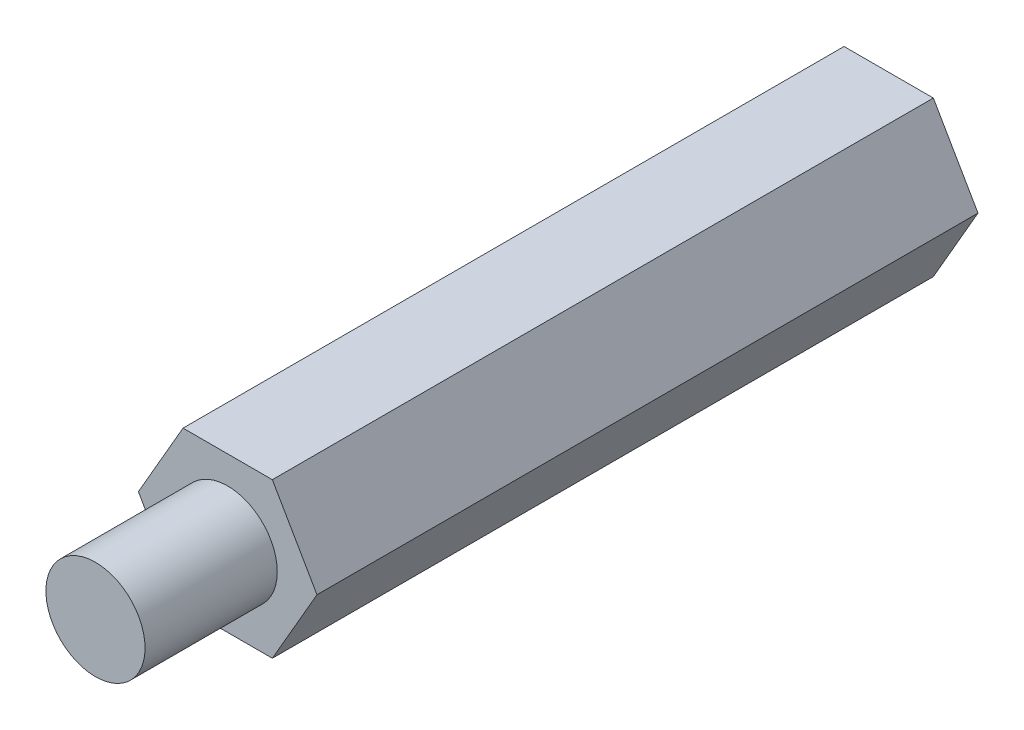
ISO-10303-21;
HEADER;
FILE_DESCRIPTION(('STEP AP214'),'2;1');
FILE_NAME('part.step','',(''),(''),'','','');
FILE_SCHEMA(('AUTOMOTIVE_DESIGN { 1 0 10303 214 1 1 1 1 }'));
ENDSEC;
DATA;
#1=APPLICATION_CONTEXT('core data for automotive mechanical design processes');
#2=APPLICATION_PROTOCOL_DEFINITION('international standard','automotive_design',2000,#1);
#3=PRODUCT_CONTEXT('',#1,'mechanical');
#4=PRODUCT('Part','Part','',(#3));
#5=PRODUCT_RELATED_PRODUCT_CATEGORY('part','',(#4));
#6=PRODUCT_DEFINITION_FORMATION('','',#4);
#7=PRODUCT_DEFINITION_CONTEXT('part definition',#1,'design');
#8=PRODUCT_DEFINITION('design','',#6,#7);
#9=PRODUCT_DEFINITION_SHAPE('','',#8);
#10=(LENGTH_UNIT() NAMED_UNIT(*) SI_UNIT(.MILLI.,.METRE.));
#11=(NAMED_UNIT(*) PLANE_ANGLE_UNIT() SI_UNIT($,.RADIAN.));
#12=(NAMED_UNIT(*) SI_UNIT($,.STERADIAN.) SOLID_ANGLE_UNIT());
#13=UNCERTAINTY_MEASURE_WITH_UNIT(LENGTH_MEASURE(1.E-05),#10,'distance_accuracy_value','');
#14=(GEOMETRIC_REPRESENTATION_CONTEXT(3) GLOBAL_UNCERTAINTY_ASSIGNED_CONTEXT((#13)) GLOBAL_UNIT_ASSIGNED_CONTEXT((#10,
#11,#12)) REPRESENTATION_CONTEXT('',''));
#15=CARTESIAN_POINT('',(0.,0.,0.));
#16=DIRECTION('',(0.,0.,1.));
#17=DIRECTION('',(1.,0.,0.));
#18=AXIS2_PLACEMENT_3D('',#15,#16,#17);
#19=CARTESIAN_POINT('',(1.35099962990375,-2.33999999999999,20.));
#20=DIRECTION('',(-0.866025403784442,0.499999999999995,0.));
#21=DIRECTION('',(-0.499999999999995,-0.866025403784442,0.));
#22=AXIS2_PLACEMENT_3D('',#19,#20,#21);
#23=PLANE('',#22);
#24=DIRECTION('',(0.499999999999995,0.866025403784441,0.));
#25=VECTOR('',#24,1.);
#26=CARTESIAN_POINT('',(1.35099962990375,-2.33999999999999,0.));
#27=LINE('',#26,#25);
#28=CARTESIAN_POINT('',(1.35099962990375,-2.33999999999999,0.));
#29=VERTEX_POINT('',#28);
#30=CARTESIAN_POINT('',(2.70199925980745,0.,0.));
#31=VERTEX_POINT('',#30);
#32=EDGE_CURVE('E125',#29,#31,#27,.T.);
#33=ORIENTED_EDGE('',*,*,#32,.T.);
#34=DIRECTION('',(0.,0.,-1.));
#35=VECTOR('',#34,1.);
#36=CARTESIAN_POINT('',(2.70199925980745,0.,20.));
#37=LINE('',#36,#35);
#38=CARTESIAN_POINT('',(2.70199925980745,0.,20.));
#39=VERTEX_POINT('',#38);
#40=EDGE_CURVE('E40',#39,#31,#37,.T.);
#41=ORIENTED_EDGE('',*,*,#40,.F.);
#42=DIRECTION('',(0.499999999999995,0.866025403784441,0.));
#43=VECTOR('',#42,1.);
#44=CARTESIAN_POINT('',(1.35099962990375,-2.33999999999999,20.));
#45=LINE('',#44,#43);
#46=CARTESIAN_POINT('',(1.35099962990375,-2.33999999999999,20.));
#47=VERTEX_POINT('',#46);
#48=EDGE_CURVE('E136',#47,#39,#45,.T.);
#49=ORIENTED_EDGE('',*,*,#48,.F.);
#50=DIRECTION('',(0.,0.,-1.));
#51=VECTOR('',#50,1.);
#52=CARTESIAN_POINT('',(1.35099962990375,-2.33999999999999,20.));
#53=LINE('',#52,#51);
#54=EDGE_CURVE('E121',#47,#29,#53,.T.);
#55=ORIENTED_EDGE('',*,*,#54,.T.);
#56=EDGE_LOOP('',(#33,#41,#49,#55));
#57=FACE_BOUND('',#56,.T.);
#58=ADVANCED_FACE('F37',(#57),#23,.F.);
#59=CARTESIAN_POINT('',(2.70199925980745,0.,20.));
#60=DIRECTION('',(-0.866025403784438,-0.500000000000001,0.));
#61=DIRECTION('',(0.500000000000001,-0.866025403784438,0.));
#62=AXIS2_PLACEMENT_3D('',#59,#60,#61);
#63=PLANE('',#62);
#64=DIRECTION('',(-0.500000000000001,0.866025403784438,0.));
#65=VECTOR('',#64,1.);
#66=CARTESIAN_POINT('',(2.70199925980745,0.,0.));
#67=LINE('',#66,#65);
#68=CARTESIAN_POINT('',(1.35099962990372,2.34,0.));
#69=VERTEX_POINT('',#68);
#70=EDGE_CURVE('E128',#31,#69,#67,.T.);
#71=ORIENTED_EDGE('',*,*,#70,.T.);
#72=DIRECTION('',(0.,0.,-1.));
#73=VECTOR('',#72,1.);
#74=CARTESIAN_POINT('',(1.35099962990372,2.34,20.));
#75=LINE('',#74,#73);
#76=CARTESIAN_POINT('',(1.35099962990372,2.34,20.));
#77=VERTEX_POINT('',#76);
#78=EDGE_CURVE('E139',#77,#69,#75,.T.);
#79=ORIENTED_EDGE('',*,*,#78,.F.);
#80=DIRECTION('',(-0.500000000000001,0.866025403784438,0.));
#81=VECTOR('',#80,1.);
#82=CARTESIAN_POINT('',(2.70199925980745,0.,20.));
#83=LINE('',#82,#81);
#84=EDGE_CURVE('E93',#39,#77,#83,.T.);
#85=ORIENTED_EDGE('',*,*,#84,.F.);
#86=ORIENTED_EDGE('',*,*,#40,.T.);
#87=EDGE_LOOP('',(#71,#79,#85,#86));
#88=FACE_BOUND('',#87,.T.);
#89=ADVANCED_FACE('F144',(#88),#63,.F.);
#90=CARTESIAN_POINT('',(1.35099962990372,2.34,20.));
#91=DIRECTION('',(0.,-1.,0.));
#92=DIRECTION('',(1.,0.,0.));
#93=AXIS2_PLACEMENT_3D('',#90,#91,#92);
#94=PLANE('',#93);
#95=DIRECTION('',(-1.,0.,0.));
#96=VECTOR('',#95,1.);
#97=CARTESIAN_POINT('',(1.35099962990372,2.34,0.));
#98=LINE('',#97,#96);
#99=CARTESIAN_POINT('',(-1.35099962990374,2.34,0.));
#100=VERTEX_POINT('',#99);
#101=EDGE_CURVE('E131',#69,#100,#98,.T.);
#102=ORIENTED_EDGE('',*,*,#101,.T.);
#103=DIRECTION('',(0.,0.,-1.));
#104=VECTOR('',#103,1.);
#105=CARTESIAN_POINT('',(-1.35099962990374,2.34,20.));
#106=LINE('',#105,#104);
#107=CARTESIAN_POINT('',(-1.35099962990374,2.34,20.));
#108=VERTEX_POINT('',#107);
#109=EDGE_CURVE('E116',#108,#100,#106,.T.);
#110=ORIENTED_EDGE('',*,*,#109,.F.);
#111=DIRECTION('',(-1.,0.,0.));
#112=VECTOR('',#111,1.);
#113=CARTESIAN_POINT('',(1.35099962990372,2.34,20.));
#114=LINE('',#113,#112);
#115=EDGE_CURVE('E107',#77,#108,#114,.T.);
#116=ORIENTED_EDGE('',*,*,#115,.F.);
#117=ORIENTED_EDGE('',*,*,#78,.T.);
#118=EDGE_LOOP('',(#102,#110,#116,#117));
#119=FACE_BOUND('',#118,.T.);
#120=ADVANCED_FACE('F150',(#119),#94,.F.);
#121=CARTESIAN_POINT('',(-1.35099962990374,2.34,20.));
#122=DIRECTION('',(0.866025403784442,-0.499999999999995,0.));
#123=DIRECTION('',(0.499999999999995,0.866025403784442,0.));
#124=AXIS2_PLACEMENT_3D('',#121,#122,#123);
#125=PLANE('',#124);
#126=DIRECTION('',(-0.499999999999995,-0.866025403784442,0.));
#127=VECTOR('',#126,1.);
#128=CARTESIAN_POINT('',(-1.35099962990374,2.34,0.));
#129=LINE('',#128,#127);
#130=CARTESIAN_POINT('',(-2.70199925980745,0.,0.));
#131=VERTEX_POINT('',#130);
#132=EDGE_CURVE('E115',#100,#131,#129,.T.);
#133=ORIENTED_EDGE('',*,*,#132,.T.);
#134=DIRECTION('',(0.,0.,-1.));
#135=VECTOR('',#134,1.);
#136=CARTESIAN_POINT('',(-2.70199925980745,0.,20.));
#137=LINE('',#136,#135);
#138=CARTESIAN_POINT('',(-2.70199925980745,0.,20.));
#139=VERTEX_POINT('',#138);
#140=EDGE_CURVE('E112',#139,#131,#137,.T.);
#141=ORIENTED_EDGE('',*,*,#140,.F.);
#142=DIRECTION('',(-0.499999999999995,-0.866025403784442,0.));
#143=VECTOR('',#142,1.);
#144=CARTESIAN_POINT('',(-1.35099962990374,2.34,20.));
#145=LINE('',#144,#143);
#146=EDGE_CURVE('E101',#108,#139,#145,.T.);
#147=ORIENTED_EDGE('',*,*,#146,.F.);
#148=ORIENTED_EDGE('',*,*,#109,.T.);
#149=EDGE_LOOP('',(#133,#141,#147,#148));
#150=FACE_BOUND('',#149,.T.);
#151=ADVANCED_FACE('F113',(#150),#125,.F.);
#152=CARTESIAN_POINT('',(-2.70199925980745,0.,20.));
#153=DIRECTION('',(0.866025403784435,0.500000000000007,0.));
#154=DIRECTION('',(-0.500000000000007,0.866025403784435,0.));
#155=AXIS2_PLACEMENT_3D('',#152,#153,#154);
#156=PLANE('',#155);
#157=DIRECTION('',(0.500000000000007,-0.866025403784435,0.));
#158=VECTOR('',#157,1.);
#159=CARTESIAN_POINT('',(-2.70199925980745,0.,0.));
#160=LINE('',#159,#158);
#161=CARTESIAN_POINT('',(-1.3509996299037,-2.34000000000001,0.));
#162=VERTEX_POINT('',#161);
#163=EDGE_CURVE('E78',#131,#162,#160,.T.);
#164=ORIENTED_EDGE('',*,*,#163,.T.);
#165=DIRECTION('',(0.,0.,-1.));
#166=VECTOR('',#165,1.);
#167=CARTESIAN_POINT('',(-1.3509996299037,-2.34000000000001,20.));
#168=LINE('',#167,#166);
#169=CARTESIAN_POINT('',(-1.3509996299037,-2.34000000000001,20.));
#170=VERTEX_POINT('',#169);
#171=EDGE_CURVE('E117',#170,#162,#168,.T.);
#172=ORIENTED_EDGE('',*,*,#171,.F.);
#173=DIRECTION('',(0.500000000000007,-0.866025403784435,0.));
#174=VECTOR('',#173,1.);
#175=CARTESIAN_POINT('',(-2.70199925980745,0.,20.));
#176=LINE('',#175,#174);
#177=EDGE_CURVE('E105',#139,#170,#176,.T.);
#178=ORIENTED_EDGE('',*,*,#177,.F.);
#179=ORIENTED_EDGE('',*,*,#140,.T.);
#180=EDGE_LOOP('',(#164,#172,#178,#179));
#181=FACE_BOUND('',#180,.T.);
#182=ADVANCED_FACE('F119',(#181),#156,.F.);
#183=CARTESIAN_POINT('',(-1.3509996299037,-2.34000000000001,20.));
#184=DIRECTION('',(0.,1.,0.));
#185=DIRECTION('',(-1.,0.,0.));
#186=AXIS2_PLACEMENT_3D('',#183,#184,#185);
#187=PLANE('',#186);
#188=DIRECTION('',(1.,0.,0.));
#189=VECTOR('',#188,1.);
#190=CARTESIAN_POINT('',(-1.3509996299037,-2.34000000000001,0.));
#191=LINE('',#190,#189);
#192=EDGE_CURVE('E84',#162,#29,#191,.T.);
#193=ORIENTED_EDGE('',*,*,#192,.T.);
#194=ORIENTED_EDGE('',*,*,#54,.F.);
#195=DIRECTION('',(1.,0.,0.));
#196=VECTOR('',#195,1.);
#197=CARTESIAN_POINT('',(-1.3509996299037,-2.34000000000001,20.));
#198=LINE('',#197,#196);
#199=EDGE_CURVE('E54',#170,#47,#198,.T.);
#200=ORIENTED_EDGE('',*,*,#199,.F.);
#201=ORIENTED_EDGE('',*,*,#171,.T.);
#202=EDGE_LOOP('',(#193,#194,#200,#201));
#203=FACE_BOUND('',#202,.T.);
#204=ADVANCED_FACE('F175',(#203),#187,.F.);
#205=CARTESIAN_POINT('',(0.,0.,20.));
#206=DIRECTION('',(0.,0.,1.));
#207=DIRECTION('',(1.,0.,0.));
#208=AXIS2_PLACEMENT_3D('',#205,#206,#207);
#209=PLANE('',#208);
#210=CARTESIAN_POINT('',(0.,0.,20.));
#211=DIRECTION('',(0.,0.,1.));
#212=DIRECTION('',(1.,0.,0.));
#213=AXIS2_PLACEMENT_3D('',#210,#211,#212);
#214=CIRCLE('',#213,1.5);
#215=CARTESIAN_POINT('',(1.5,0.,20.));
#216=VERTEX_POINT('',#215);
#217=EDGE_CURVE('E11',#216,#216,#214,.T.);
#218=ORIENTED_EDGE('',*,*,#217,.F.);
#219=EDGE_LOOP('',(#218));
#220=FACE_BOUND('',#219,.T.);
#221=ORIENTED_EDGE('',*,*,#48,.T.);
#222=ORIENTED_EDGE('',*,*,#84,.T.);
#223=ORIENTED_EDGE('',*,*,#115,.T.);
#224=ORIENTED_EDGE('',*,*,#146,.T.);
#225=ORIENTED_EDGE('',*,*,#177,.T.);
#226=ORIENTED_EDGE('',*,*,#199,.T.);
#227=EDGE_LOOP('',(#221,#222,#223,#224,#225,#226));
#228=FACE_BOUND('',#227,.T.);
#229=ADVANCED_FACE('F103',(#220,#228),#209,.T.);
#230=CARTESIAN_POINT('',(0.,0.,0.));
#231=DIRECTION('',(0.,0.,1.));
#232=DIRECTION('',(1.,0.,0.));
#233=AXIS2_PLACEMENT_3D('',#230,#231,#232);
#234=PLANE('',#233);
#235=CARTESIAN_POINT('',(0.,0.,0.));
#236=DIRECTION('',(0.,0.,-1.));
#237=DIRECTION('',(-1.,0.,0.));
#238=AXIS2_PLACEMENT_3D('',#235,#236,#237);
#239=CIRCLE('',#238,1.24999999999999);
#240=CARTESIAN_POINT('',(-1.24999999999999,0.,0.));
#241=VERTEX_POINT('',#240);
#242=EDGE_CURVE('E159',#241,#241,#239,.T.);
#243=ORIENTED_EDGE('',*,*,#242,.F.);
#244=EDGE_LOOP('',(#243));
#245=FACE_BOUND('',#244,.T.);
#246=ORIENTED_EDGE('',*,*,#32,.F.);
#247=ORIENTED_EDGE('',*,*,#192,.F.);
#248=ORIENTED_EDGE('',*,*,#163,.F.);
#249=ORIENTED_EDGE('',*,*,#132,.F.);
#250=ORIENTED_EDGE('',*,*,#101,.F.);
#251=ORIENTED_EDGE('',*,*,#70,.F.);
#252=EDGE_LOOP('',(#246,#247,#248,#249,#250,#251));
#253=FACE_BOUND('',#252,.T.);
#254=ADVANCED_FACE('F149',(#245,#253),#234,.F.);
#255=CARTESIAN_POINT('',(0.,0.,24.));
#256=DIRECTION('',(0.,0.,-1.));
#257=DIRECTION('',(-1.,0.,0.));
#258=AXIS2_PLACEMENT_3D('',#255,#256,#257);
#259=CYLINDRICAL_SURFACE('',#258,1.5);
#260=CARTESIAN_POINT('',(0.,0.,24.));
#261=DIRECTION('',(0.,0.,1.));
#262=DIRECTION('',(1.,0.,0.));
#263=AXIS2_PLACEMENT_3D('',#260,#261,#262);
#264=CIRCLE('',#263,1.5);
#265=CARTESIAN_POINT('',(1.5,0.,24.));
#266=VERTEX_POINT('',#265);
#267=EDGE_CURVE('E129',#266,#266,#264,.T.);
#268=ORIENTED_EDGE('',*,*,#267,.F.);
#269=EDGE_LOOP('',(#268));
#270=FACE_BOUND('',#269,.T.);
#271=ORIENTED_EDGE('',*,*,#217,.T.);
#272=EDGE_LOOP('',(#271));
#273=FACE_BOUND('',#272,.T.);
#274=ADVANCED_FACE('F166',(#270,#273),#259,.T.);
#275=CARTESIAN_POINT('',(0.,0.,24.));
#276=DIRECTION('',(0.,0.,1.));
#277=DIRECTION('',(1.,0.,0.));
#278=AXIS2_PLACEMENT_3D('',#275,#276,#277);
#279=PLANE('',#278);
#280=ORIENTED_EDGE('',*,*,#267,.T.);
#281=EDGE_LOOP('',(#280));
#282=FACE_BOUND('',#281,.T.);
#283=ADVANCED_FACE('F172',(#282),#279,.T.);
#284=CARTESIAN_POINT('',(0.,0.,5.));
#285=DIRECTION('',(0.,0.,-1.));
#286=DIRECTION('',(-1.,0.,0.));
#287=AXIS2_PLACEMENT_3D('',#284,#285,#286);
#288=CONICAL_SURFACE('',#287,1.25,1.02974425867665);
#289=CARTESIAN_POINT('',(0.,0.,5.75107577378445));
#290=VERTEX_POINT('',#289);
#291=VERTEX_LOOP('',#290);
#292=FACE_BOUND('',#291,.T.);
#293=CARTESIAN_POINT('',(0.,0.,5.));
#294=DIRECTION('',(0.,0.,-1.));
#295=DIRECTION('',(-1.,0.,0.));
#296=AXIS2_PLACEMENT_3D('',#293,#294,#295);
#297=CIRCLE('',#296,1.25);
#298=CARTESIAN_POINT('',(-1.25,0.,5.));
#299=VERTEX_POINT('',#298);
#300=EDGE_CURVE('E156',#299,#299,#297,.T.);
#301=ORIENTED_EDGE('',*,*,#300,.T.);
#302=EDGE_LOOP('',(#301));
#303=FACE_BOUND('',#302,.T.);
#304=ADVANCED_FACE('F216',(#292,#303),#288,.F.);
#305=CARTESIAN_POINT('',(0.,0.,0.));
#306=DIRECTION('',(0.,0.,-1.));
#307=DIRECTION('',(-1.,0.,0.));
#308=AXIS2_PLACEMENT_3D('',#305,#306,#307);
#309=CYLINDRICAL_SURFACE('',#308,1.24999999999999);
#310=ORIENTED_EDGE('',*,*,#300,.F.);
#311=EDGE_LOOP('',(#310));
#312=FACE_BOUND('',#311,.T.);
#313=ORIENTED_EDGE('',*,*,#242,.T.);
#314=EDGE_LOOP('',(#313));
#315=FACE_BOUND('',#314,.T.);
#316=ADVANCED_FACE('F163',(#312,#315),#309,.F.);
#317=CLOSED_SHELL('',(#58,#89,#120,#151,#182,#204,#229,#254,#274,#283,#304,#316));
#318=MANIFOLD_SOLID_BREP('B2',#317);
#319=ADVANCED_BREP_SHAPE_REPRESENTATION('',(#18,#318),#14);
#320=SHAPE_DEFINITION_REPRESENTATION(#9,#319);
ENDSEC;
END-ISO-10303-21;
